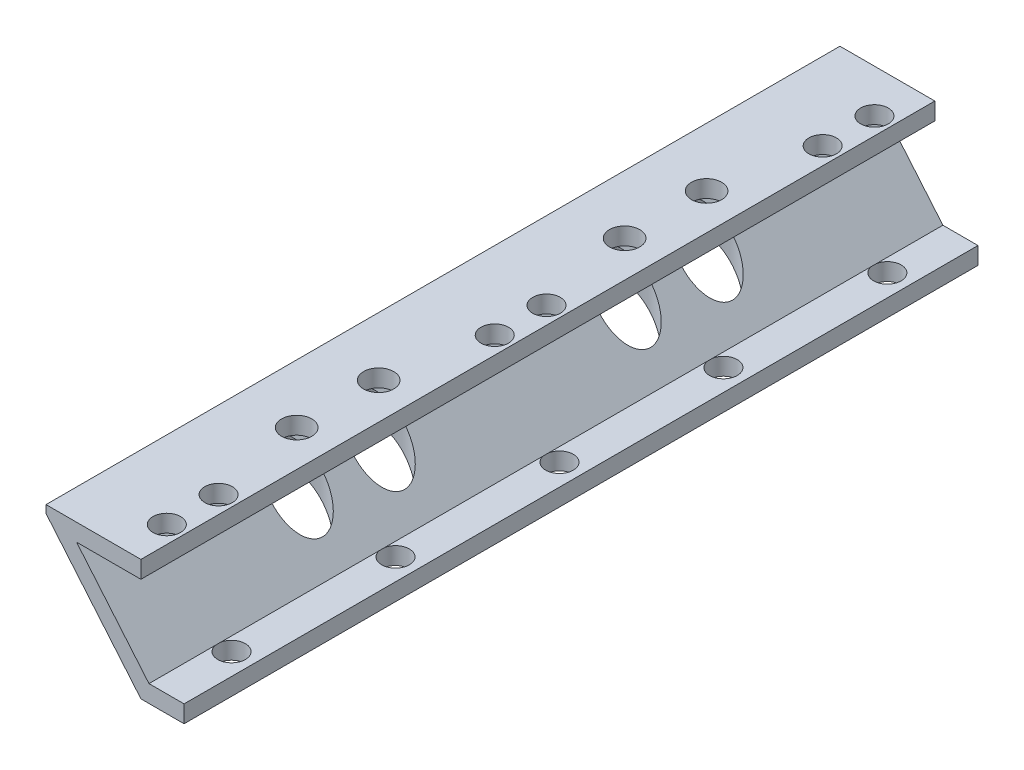
ISO-10303-21;
HEADER;
FILE_DESCRIPTION(('STEP AP214'),'2;1');
FILE_NAME('part.step','',(''),(''),'','','');
FILE_SCHEMA(('AUTOMOTIVE_DESIGN { 1 0 10303 214 1 1 1 1 }'));
ENDSEC;
DATA;
#1=APPLICATION_CONTEXT('core data for automotive mechanical design processes');
#2=APPLICATION_PROTOCOL_DEFINITION('international standard','automotive_design',2000,#1);
#3=PRODUCT_CONTEXT('',#1,'mechanical');
#4=PRODUCT('Part','Part','',(#3));
#5=PRODUCT_RELATED_PRODUCT_CATEGORY('part','',(#4));
#6=PRODUCT_DEFINITION_FORMATION('','',#4);
#7=PRODUCT_DEFINITION_CONTEXT('part definition',#1,'design');
#8=PRODUCT_DEFINITION('design','',#6,#7);
#9=PRODUCT_DEFINITION_SHAPE('','',#8);
#10=(LENGTH_UNIT() NAMED_UNIT(*) SI_UNIT(.MILLI.,.METRE.));
#11=(NAMED_UNIT(*) PLANE_ANGLE_UNIT() SI_UNIT($,.RADIAN.));
#12=(NAMED_UNIT(*) SI_UNIT($,.STERADIAN.) SOLID_ANGLE_UNIT());
#13=UNCERTAINTY_MEASURE_WITH_UNIT(LENGTH_MEASURE(1.E-05),#10,'distance_accuracy_value','');
#14=(GEOMETRIC_REPRESENTATION_CONTEXT(3) GLOBAL_UNCERTAINTY_ASSIGNED_CONTEXT((#13)) GLOBAL_UNIT_ASSIGNED_CONTEXT((#10,
#11,#12)) REPRESENTATION_CONTEXT('',''));
#15=CARTESIAN_POINT('',(0.,0.,0.));
#16=DIRECTION('',(0.,0.,1.));
#17=DIRECTION('',(1.,0.,0.));
#18=AXIS2_PLACEMENT_3D('',#15,#16,#17);
#19=CARTESIAN_POINT('',(-11.,12.,46.));
#20=DIRECTION('',(1.,0.,0.));
#21=DIRECTION('',(0.,0.,-1.));
#22=AXIS2_PLACEMENT_3D('',#19,#20,#21);
#23=PLANE('',#22);
#24=DIRECTION('',(0.,0.,-1.));
#25=VECTOR('',#24,1.);
#26=CARTESIAN_POINT('',(-11.,13.1092895185364,46.));
#27=LINE('',#26,#25);
#28=CARTESIAN_POINT('',(-11.,13.1092895185364,46.));
#29=VERTEX_POINT('',#28);
#30=CARTESIAN_POINT('',(-11.,13.1092895185363,-46.));
#31=VERTEX_POINT('',#30);
#32=EDGE_CURVE('E137',#29,#31,#27,.T.);
#33=ORIENTED_EDGE('',*,*,#32,.F.);
#34=DIRECTION('',(0.,-1.,0.));
#35=VECTOR('',#34,1.);
#36=CARTESIAN_POINT('',(-11.,12.,46.));
#37=LINE('',#36,#35);
#38=CARTESIAN_POINT('',(-11.,14.,46.));
#39=VERTEX_POINT('',#38);
#40=EDGE_CURVE('E147',#39,#29,#37,.T.);
#41=ORIENTED_EDGE('',*,*,#40,.F.);
#42=DIRECTION('',(0.,0.,-1.));
#43=VECTOR('',#42,1.);
#44=CARTESIAN_POINT('',(-11.,14.,46.));
#45=LINE('',#44,#43);
#46=CARTESIAN_POINT('',(-11.,14.,-46.));
#47=VERTEX_POINT('',#46);
#48=EDGE_CURVE('E154',#39,#47,#45,.T.);
#49=ORIENTED_EDGE('',*,*,#48,.T.);
#50=DIRECTION('',(0.,-1.,0.));
#51=VECTOR('',#50,1.);
#52=CARTESIAN_POINT('',(-11.,12.,-46.));
#53=LINE('',#52,#51);
#54=EDGE_CURVE('E143',#47,#31,#53,.T.);
#55=ORIENTED_EDGE('',*,*,#54,.T.);
#56=EDGE_LOOP('',(#33,#41,#49,#55));
#57=FACE_BOUND('',#56,.T.);
#58=ADVANCED_FACE('F33',(#57),#23,.F.);
#59=CARTESIAN_POINT('',(0.,0.,46.));
#60=DIRECTION('',(0.,0.,-1.));
#61=DIRECTION('',(-1.,0.,0.));
#62=AXIS2_PLACEMENT_3D('',#59,#60,#61);
#63=PLANE('',#62);
#64=ORIENTED_EDGE('',*,*,#40,.T.);
#65=DIRECTION('',(0.642787609686538,-0.766044443118979,0.));
#66=VECTOR('',#65,1.);
#67=CARTESIAN_POINT('',(0.,0.,46.));
#68=LINE('',#67,#66);
#69=CARTESIAN_POINT('',(0.,0.,46.));
#70=VERTEX_POINT('',#69);
#71=EDGE_CURVE('E135',#29,#70,#68,.T.);
#72=ORIENTED_EDGE('',*,*,#71,.T.);
#73=DIRECTION('',(1.,0.,0.));
#74=VECTOR('',#73,1.);
#75=CARTESIAN_POINT('',(4.99999999999773,0.,46.));
#76=LINE('',#75,#74);
#77=CARTESIAN_POINT('',(4.99999999999773,0.,46.));
#78=VERTEX_POINT('',#77);
#79=EDGE_CURVE('E142',#70,#78,#76,.T.);
#80=ORIENTED_EDGE('',*,*,#79,.T.);
#81=DIRECTION('',(0.,1.,0.));
#82=VECTOR('',#81,1.);
#83=CARTESIAN_POINT('',(4.99999999999773,2.00000000000477,46.));
#84=LINE('',#83,#82);
#85=CARTESIAN_POINT('',(4.99999999999773,2.00000000000477,46.));
#86=VERTEX_POINT('',#85);
#87=EDGE_CURVE('E183',#78,#86,#84,.T.);
#88=ORIENTED_EDGE('',*,*,#87,.T.);
#89=DIRECTION('',(-1.,-1.17531647254689E-12,0.));
#90=VECTOR('',#89,1.);
#91=CARTESIAN_POINT('',(0.932615316310018,1.99999999999999,46.));
#92=LINE('',#91,#90);
#93=CARTESIAN_POINT('',(0.932615316310018,1.99999999999999,46.));
#94=VERTEX_POINT('',#93);
#95=EDGE_CURVE('E215',#86,#94,#92,.T.);
#96=ORIENTED_EDGE('',*,*,#95,.T.);
#97=DIRECTION('',(-0.642787609686539,0.766044443118979,0.));
#98=VECTOR('',#97,1.);
#99=CARTESIAN_POINT('',(-7.45838099546278,12.,46.));
#100=LINE('',#99,#98);
#101=CARTESIAN_POINT('',(-7.45838099546278,12.,46.));
#102=VERTEX_POINT('',#101);
#103=EDGE_CURVE('E217',#94,#102,#100,.T.);
#104=ORIENTED_EDGE('',*,*,#103,.T.);
#105=DIRECTION('',(1.,0.,0.));
#106=VECTOR('',#105,1.);
#107=CARTESIAN_POINT('',(0.,12.,46.));
#108=LINE('',#107,#106);
#109=CARTESIAN_POINT('',(0.,12.,46.));
#110=VERTEX_POINT('',#109);
#111=EDGE_CURVE('E219',#102,#110,#108,.T.);
#112=ORIENTED_EDGE('',*,*,#111,.T.);
#113=DIRECTION('',(0.,1.,0.));
#114=VECTOR('',#113,1.);
#115=CARTESIAN_POINT('',(0.,14.,46.));
#116=LINE('',#115,#114);
#117=CARTESIAN_POINT('',(0.,14.,46.));
#118=VERTEX_POINT('',#117);
#119=EDGE_CURVE('E158',#110,#118,#116,.T.);
#120=ORIENTED_EDGE('',*,*,#119,.T.);
#121=DIRECTION('',(-1.,0.,0.));
#122=VECTOR('',#121,1.);
#123=CARTESIAN_POINT('',(-11.,14.,46.));
#124=LINE('',#123,#122);
#125=EDGE_CURVE('E152',#118,#39,#124,.T.);
#126=ORIENTED_EDGE('',*,*,#125,.T.);
#127=EDGE_LOOP('',(#64,#72,#80,#88,#96,#104,#112,#120,#126));
#128=FACE_BOUND('',#127,.T.);
#129=ADVANCED_FACE('F150',(#128),#63,.F.);
#130=CARTESIAN_POINT('',(0.,0.,-46.));
#131=DIRECTION('',(0.,0.,-1.));
#132=DIRECTION('',(-1.,0.,0.));
#133=AXIS2_PLACEMENT_3D('',#130,#131,#132);
#134=PLANE('',#133);
#135=DIRECTION('',(0.642787609686538,-0.766044443118979,0.));
#136=VECTOR('',#135,1.);
#137=CARTESIAN_POINT('',(0.,0.,-46.));
#138=LINE('',#137,#136);
#139=CARTESIAN_POINT('',(0.,0.,-46.));
#140=VERTEX_POINT('',#139);
#141=EDGE_CURVE('E48',#31,#140,#138,.T.);
#142=ORIENTED_EDGE('',*,*,#141,.F.);
#143=ORIENTED_EDGE('',*,*,#54,.F.);
#144=DIRECTION('',(-1.,0.,0.));
#145=VECTOR('',#144,1.);
#146=CARTESIAN_POINT('',(-11.,14.,-46.));
#147=LINE('',#146,#145);
#148=CARTESIAN_POINT('',(0.,14.,-46.));
#149=VERTEX_POINT('',#148);
#150=EDGE_CURVE('E209',#149,#47,#147,.T.);
#151=ORIENTED_EDGE('',*,*,#150,.F.);
#152=DIRECTION('',(0.,1.,0.));
#153=VECTOR('',#152,1.);
#154=CARTESIAN_POINT('',(0.,14.,-46.));
#155=LINE('',#154,#153);
#156=CARTESIAN_POINT('',(0.,12.,-46.));
#157=VERTEX_POINT('',#156);
#158=EDGE_CURVE('E206',#157,#149,#155,.T.);
#159=ORIENTED_EDGE('',*,*,#158,.F.);
#160=DIRECTION('',(1.,0.,0.));
#161=VECTOR('',#160,1.);
#162=CARTESIAN_POINT('',(0.,12.,-46.));
#163=LINE('',#162,#161);
#164=CARTESIAN_POINT('',(-7.45838099546278,12.,-46.));
#165=VERTEX_POINT('',#164);
#166=EDGE_CURVE('E203',#165,#157,#163,.T.);
#167=ORIENTED_EDGE('',*,*,#166,.F.);
#168=DIRECTION('',(-0.642787609686539,0.766044443118979,0.));
#169=VECTOR('',#168,1.);
#170=CARTESIAN_POINT('',(-7.45838099546278,12.,-46.));
#171=LINE('',#170,#169);
#172=CARTESIAN_POINT('',(0.932615316310018,1.99999999999999,-46.));
#173=VERTEX_POINT('',#172);
#174=EDGE_CURVE('E200',#173,#165,#171,.T.);
#175=ORIENTED_EDGE('',*,*,#174,.F.);
#176=DIRECTION('',(-1.,-1.17531647254689E-12,0.));
#177=VECTOR('',#176,1.);
#178=CARTESIAN_POINT('',(0.932615316310018,1.99999999999999,-46.));
#179=LINE('',#178,#177);
#180=CARTESIAN_POINT('',(4.99999999999773,2.00000000000477,-46.));
#181=VERTEX_POINT('',#180);
#182=EDGE_CURVE('E191',#181,#173,#179,.T.);
#183=ORIENTED_EDGE('',*,*,#182,.F.);
#184=DIRECTION('',(0.,1.,0.));
#185=VECTOR('',#184,1.);
#186=CARTESIAN_POINT('',(4.99999999999773,2.00000000000477,-46.));
#187=LINE('',#186,#185);
#188=CARTESIAN_POINT('',(4.99999999999773,0.,-46.));
#189=VERTEX_POINT('',#188);
#190=EDGE_CURVE('E182',#189,#181,#187,.T.);
#191=ORIENTED_EDGE('',*,*,#190,.F.);
#192=DIRECTION('',(1.,0.,0.));
#193=VECTOR('',#192,1.);
#194=CARTESIAN_POINT('',(4.99999999999773,0.,-46.));
#195=LINE('',#194,#193);
#196=EDGE_CURVE('E188',#140,#189,#195,.T.);
#197=ORIENTED_EDGE('',*,*,#196,.F.);
#198=EDGE_LOOP('',(#142,#143,#151,#159,#167,#175,#183,#191,#197));
#199=FACE_BOUND('',#198,.T.);
#200=ADVANCED_FACE('F187',(#199),#134,.T.);
#201=CARTESIAN_POINT('',(0.,0.,46.));
#202=DIRECTION('',(0.766044443118979,0.642787609686538,0.));
#203=DIRECTION('',(-0.642787609686538,0.766044443118979,0.));
#204=AXIS2_PLACEMENT_3D('',#201,#202,#203);
#205=PLANE('',#204);
#206=CARTESIAN_POINT('',(-4.19999999999866,5.0053650888941,-23.7500000000026));
#207=DIRECTION('',(0.766044443118979,0.642787609686538,0.));
#208=DIRECTION('',(-0.642787609686538,0.766044443118979,0.));
#209=AXIS2_PLACEMENT_3D('',#206,#207,#208);
#210=ELLIPSE('',#209,4.66717148058125,3.);
#211=CARTESIAN_POINT('',(-7.19999999999866,8.58062586667674,-23.7500000000026));
#212=VERTEX_POINT('',#211);
#213=EDGE_CURVE('E653',#212,#212,#210,.F.);
#214=ORIENTED_EDGE('',*,*,#213,.F.);
#215=EDGE_LOOP('',(#214));
#216=FACE_BOUND('',#215,.T.);
#217=CARTESIAN_POINT('',(-4.19999999999866,5.0053650888941,-14.2500000000012));
#218=DIRECTION('',(0.766044443118979,0.642787609686538,0.));
#219=DIRECTION('',(-0.642787609686538,0.766044443118979,0.));
#220=AXIS2_PLACEMENT_3D('',#217,#218,#219);
#221=ELLIPSE('',#220,4.66717148058125,3.);
#222=CARTESIAN_POINT('',(-7.19999999999866,8.58062586667674,-14.2500000000012));
#223=VERTEX_POINT('',#222);
#224=EDGE_CURVE('E657',#223,#223,#221,.F.);
#225=ORIENTED_EDGE('',*,*,#224,.F.);
#226=EDGE_LOOP('',(#225));
#227=FACE_BOUND('',#226,.T.);
#228=CARTESIAN_POINT('',(-4.19999999999865,5.0053650888941,14.2500000000012));
#229=DIRECTION('',(0.766044443118979,0.642787609686538,0.));
#230=DIRECTION('',(-0.642787609686538,0.766044443118979,0.));
#231=AXIS2_PLACEMENT_3D('',#228,#229,#230);
#232=ELLIPSE('',#231,4.66717148058125,3.);
#233=CARTESIAN_POINT('',(-7.19999999999866,8.58062586667674,14.2500000000012));
#234=VERTEX_POINT('',#233);
#235=EDGE_CURVE('E666',#234,#234,#232,.F.);
#236=ORIENTED_EDGE('',*,*,#235,.F.);
#237=EDGE_LOOP('',(#236));
#238=FACE_BOUND('',#237,.T.);
#239=CARTESIAN_POINT('',(-4.19999999999865,5.0053650888941,23.7500000000026));
#240=DIRECTION('',(0.766044443118979,0.642787609686538,0.));
#241=DIRECTION('',(-0.642787609686538,0.766044443118979,0.));
#242=AXIS2_PLACEMENT_3D('',#239,#240,#241);
#243=ELLIPSE('',#242,4.66717148058125,3.);
#244=CARTESIAN_POINT('',(-7.19999999999866,8.58062586667674,23.7500000000026));
#245=VERTEX_POINT('',#244);
#246=EDGE_CURVE('E672',#245,#245,#243,.F.);
#247=ORIENTED_EDGE('',*,*,#246,.F.);
#248=EDGE_LOOP('',(#247));
#249=FACE_BOUND('',#248,.T.);
#250=ORIENTED_EDGE('',*,*,#141,.T.);
#251=DIRECTION('',(0.,0.,-1.));
#252=VECTOR('',#251,1.);
#253=CARTESIAN_POINT('',(0.,0.,46.));
#254=LINE('',#253,#252);
#255=EDGE_CURVE('E11',#70,#140,#254,.T.);
#256=ORIENTED_EDGE('',*,*,#255,.F.);
#257=ORIENTED_EDGE('',*,*,#71,.F.);
#258=ORIENTED_EDGE('',*,*,#32,.T.);
#259=EDGE_LOOP('',(#250,#256,#257,#258));
#260=FACE_BOUND('',#259,.T.);
#261=ADVANCED_FACE('F35',(#216,#227,#238,#249,#260),#205,.F.);
#262=CARTESIAN_POINT('',(-7.45838099546278,12.,46.));
#263=DIRECTION('',(-0.766044443118979,-0.642787609686538,0.));
#264=DIRECTION('',(0.642787609686539,-0.766044443118979,0.));
#265=AXIS2_PLACEMENT_3D('',#262,#263,#264);
#266=PLANE('',#265);
#267=CARTESIAN_POINT('',(-4.19999999999866,8.11681274261494,-14.2500000000012));
#268=DIRECTION('',(-0.766044443118979,-0.642787609686538,0.));
#269=DIRECTION('',(-0.642787609686539,0.766044443118979,0.));
#270=AXIS2_PLACEMENT_3D('',#267,#268,#269);
#271=ELLIPSE('',#270,4.66717148058125,3.);
#272=CARTESIAN_POINT('',(-7.19999999999866,11.6920735203976,-14.2500000000012));
#273=VERTEX_POINT('',#272);
#274=EDGE_CURVE('E654',#273,#273,#271,.F.);
#275=ORIENTED_EDGE('',*,*,#274,.F.);
#276=EDGE_LOOP('',(#275));
#277=FACE_BOUND('',#276,.T.);
#278=CARTESIAN_POINT('',(-4.19999999999866,8.11681274261493,23.7500000000026));
#279=DIRECTION('',(-0.766044443118979,-0.642787609686538,0.));
#280=DIRECTION('',(-0.642787609686539,0.766044443118979,0.));
#281=AXIS2_PLACEMENT_3D('',#278,#279,#280);
#282=ELLIPSE('',#281,4.66717148058125,3.);
#283=CARTESIAN_POINT('',(-7.19999999999866,11.6920735203976,23.7500000000026));
#284=VERTEX_POINT('',#283);
#285=EDGE_CURVE('E669',#284,#284,#282,.F.);
#286=ORIENTED_EDGE('',*,*,#285,.F.);
#287=EDGE_LOOP('',(#286));
#288=FACE_BOUND('',#287,.T.);
#289=DIRECTION('',(0.,0.,-1.));
#290=VECTOR('',#289,1.);
#291=CARTESIAN_POINT('',(0.932615316310018,1.99999999999999,46.));
#292=LINE('',#291,#290);
#293=CARTESIAN_POINT('',(0.932615316310018,1.99999999999999,38.3214113460168));
#294=VERTEX_POINT('',#293);
#295=EDGE_CURVE('E168',#94,#294,#292,.T.);
#296=ORIENTED_EDGE('',*,*,#295,.T.);
#297=CARTESIAN_POINT('',(0.932615316310018,1.99999999999999,37.6785886539941));
#298=VERTEX_POINT('',#297);
#299=EDGE_CURVE('E172',#294,#298,#292,.T.);
#300=ORIENTED_EDGE('',*,*,#299,.T.);
#301=CARTESIAN_POINT('',(0.932615316310018,1.99999999999999,19.3214113460141));
#302=VERTEX_POINT('',#301);
#303=EDGE_CURVE('E173',#298,#302,#292,.T.);
#304=ORIENTED_EDGE('',*,*,#303,.T.);
#305=CARTESIAN_POINT('',(0.932615316310018,1.99999999999999,18.6785886539913));
#306=VERTEX_POINT('',#305);
#307=EDGE_CURVE('E252',#302,#306,#292,.T.);
#308=ORIENTED_EDGE('',*,*,#307,.T.);
#309=CARTESIAN_POINT('',(0.932615316310018,1.99999999999999,0.321411346011401));
#310=VERTEX_POINT('',#309);
#311=EDGE_CURVE('E251',#306,#310,#292,.T.);
#312=ORIENTED_EDGE('',*,*,#311,.T.);
#313=CARTESIAN_POINT('',(0.932615316310018,1.99999999999999,-0.321411346011401));
#314=VERTEX_POINT('',#313);
#315=EDGE_CURVE('E253',#310,#314,#292,.T.);
#316=ORIENTED_EDGE('',*,*,#315,.T.);
#317=CARTESIAN_POINT('',(0.932615316310018,1.99999999999999,-18.6785886539913));
#318=VERTEX_POINT('',#317);
#319=EDGE_CURVE('E257',#314,#318,#292,.T.);
#320=ORIENTED_EDGE('',*,*,#319,.T.);
#321=CARTESIAN_POINT('',(0.932615316310018,1.99999999999999,-19.3214113460141));
#322=VERTEX_POINT('',#321);
#323=EDGE_CURVE('E259',#318,#322,#292,.T.);
#324=ORIENTED_EDGE('',*,*,#323,.T.);
#325=CARTESIAN_POINT('',(0.932615316310018,1.99999999999999,-37.6785886539941));
#326=VERTEX_POINT('',#325);
#327=EDGE_CURVE('E258',#322,#326,#292,.T.);
#328=ORIENTED_EDGE('',*,*,#327,.T.);
#329=CARTESIAN_POINT('',(0.932615316310018,1.99999999999999,-38.3214113460169));
#330=VERTEX_POINT('',#329);
#331=EDGE_CURVE('E174',#326,#330,#292,.T.);
#332=ORIENTED_EDGE('',*,*,#331,.T.);
#333=EDGE_CURVE('E167',#330,#173,#292,.T.);
#334=ORIENTED_EDGE('',*,*,#333,.T.);
#335=ORIENTED_EDGE('',*,*,#174,.T.);
#336=DIRECTION('',(0.,0.,-1.));
#337=VECTOR('',#336,1.);
#338=CARTESIAN_POINT('',(-7.45838099546278,12.,46.));
#339=LINE('',#338,#337);
#340=EDGE_CURVE('E165',#102,#165,#339,.T.);
#341=ORIENTED_EDGE('',*,*,#340,.F.);
#342=ORIENTED_EDGE('',*,*,#103,.F.);
#343=EDGE_LOOP('',(#296,#300,#304,#308,#312,#316,#320,#324,#328,#332,#334,#335,#341,#342));
#344=FACE_BOUND('',#343,.T.);
#345=CARTESIAN_POINT('',(-4.19999999999866,8.11681274261493,14.2500000000012));
#346=DIRECTION('',(-0.766044443118979,-0.642787609686538,0.));
#347=DIRECTION('',(-0.642787609686539,0.766044443118979,0.));
#348=AXIS2_PLACEMENT_3D('',#345,#346,#347);
#349=ELLIPSE('',#348,4.66717148058125,3.);
#350=CARTESIAN_POINT('',(-7.19999999999866,11.6920735203976,14.2500000000012));
#351=VERTEX_POINT('',#350);
#352=EDGE_CURVE('E663',#351,#351,#349,.F.);
#353=ORIENTED_EDGE('',*,*,#352,.F.);
#354=EDGE_LOOP('',(#353));
#355=FACE_BOUND('',#354,.T.);
#356=CARTESIAN_POINT('',(-4.19999999999866,8.11681274261494,-23.7500000000026));
#357=DIRECTION('',(-0.766044443118979,-0.642787609686538,0.));
#358=DIRECTION('',(-0.642787609686539,0.766044443118979,0.));
#359=AXIS2_PLACEMENT_3D('',#356,#357,#358);
#360=ELLIPSE('',#359,4.66717148058125,3.);
#361=CARTESIAN_POINT('',(-7.19999999999866,11.6920735203976,-23.7500000000026));
#362=VERTEX_POINT('',#361);
#363=EDGE_CURVE('E148',#362,#362,#360,.F.);
#364=ORIENTED_EDGE('',*,*,#363,.F.);
#365=EDGE_LOOP('',(#364));
#366=FACE_BOUND('',#365,.T.);
#367=ADVANCED_FACE('F237',(#277,#288,#344,#355,#366),#266,.F.);
#368=CARTESIAN_POINT('',(4.99999999999773,0.,46.));
#369=DIRECTION('',(0.,1.,0.));
#370=DIRECTION('',(0.,0.,1.));
#371=AXIS2_PLACEMENT_3D('',#368,#369,#370);
#372=PLANE('',#371);
#373=CARTESIAN_POINT('',(2.49999999999891,0.,38.0000000000055));
#374=DIRECTION('',(0.,1.,0.));
#375=DIRECTION('',(0.,0.,1.));
#376=AXIS2_PLACEMENT_3D('',#373,#374,#375);
#377=CIRCLE('',#376,1.6);
#378=CARTESIAN_POINT('',(2.49999999999891,0.,39.6000000000055));
#379=VERTEX_POINT('',#378);
#380=EDGE_CURVE('E357',#379,#379,#377,.T.);
#381=ORIENTED_EDGE('',*,*,#380,.T.);
#382=EDGE_LOOP('',(#381));
#383=FACE_BOUND('',#382,.T.);
#384=CARTESIAN_POINT('',(2.4999999999989,0.,19.0000000000027));
#385=DIRECTION('',(0.,1.,0.));
#386=DIRECTION('',(0.,0.,1.));
#387=AXIS2_PLACEMENT_3D('',#384,#385,#386);
#388=CIRCLE('',#387,1.6);
#389=CARTESIAN_POINT('',(2.4999999999989,0.,20.6000000000027));
#390=VERTEX_POINT('',#389);
#391=EDGE_CURVE('E361',#390,#390,#388,.T.);
#392=ORIENTED_EDGE('',*,*,#391,.T.);
#393=EDGE_LOOP('',(#392));
#394=FACE_BOUND('',#393,.T.);
#395=CARTESIAN_POINT('',(2.4999999999989,0.,0.));
#396=DIRECTION('',(0.,1.,0.));
#397=DIRECTION('',(0.,0.,1.));
#398=AXIS2_PLACEMENT_3D('',#395,#396,#397);
#399=CIRCLE('',#398,1.6);
#400=CARTESIAN_POINT('',(2.4999999999989,0.,1.6));
#401=VERTEX_POINT('',#400);
#402=EDGE_CURVE('E365',#401,#401,#399,.T.);
#403=ORIENTED_EDGE('',*,*,#402,.T.);
#404=EDGE_LOOP('',(#403));
#405=FACE_BOUND('',#404,.T.);
#406=CARTESIAN_POINT('',(2.4999999999989,0.,-19.0000000000027));
#407=DIRECTION('',(0.,1.,0.));
#408=DIRECTION('',(0.,0.,1.));
#409=AXIS2_PLACEMENT_3D('',#406,#407,#408);
#410=CIRCLE('',#409,1.6);
#411=CARTESIAN_POINT('',(2.4999999999989,0.,-17.4000000000027));
#412=VERTEX_POINT('',#411);
#413=EDGE_CURVE('E272',#412,#412,#410,.T.);
#414=ORIENTED_EDGE('',*,*,#413,.T.);
#415=EDGE_LOOP('',(#414));
#416=FACE_BOUND('',#415,.T.);
#417=CARTESIAN_POINT('',(2.4999999999989,0.,-38.0000000000055));
#418=DIRECTION('',(0.,1.,0.));
#419=DIRECTION('',(0.,0.,1.));
#420=AXIS2_PLACEMENT_3D('',#417,#418,#419);
#421=CIRCLE('',#420,1.6);
#422=CARTESIAN_POINT('',(2.4999999999989,0.,-36.4000000000055));
#423=VERTEX_POINT('',#422);
#424=EDGE_CURVE('E275',#423,#423,#421,.T.);
#425=ORIENTED_EDGE('',*,*,#424,.T.);
#426=EDGE_LOOP('',(#425));
#427=FACE_BOUND('',#426,.T.);
#428=ORIENTED_EDGE('',*,*,#255,.T.);
#429=ORIENTED_EDGE('',*,*,#196,.T.);
#430=DIRECTION('',(0.,0.,-1.));
#431=VECTOR('',#430,1.);
#432=CARTESIAN_POINT('',(4.99999999999773,0.,46.));
#433=LINE('',#432,#431);
#434=EDGE_CURVE('E41',#78,#189,#433,.T.);
#435=ORIENTED_EDGE('',*,*,#434,.F.);
#436=ORIENTED_EDGE('',*,*,#79,.F.);
#437=EDGE_LOOP('',(#428,#429,#435,#436));
#438=FACE_BOUND('',#437,.T.);
#439=ADVANCED_FACE('F193',(#383,#394,#405,#416,#427,#438),#372,.F.);
#440=CARTESIAN_POINT('',(4.99999999999773,2.00000000000477,46.));
#441=DIRECTION('',(-1.,0.,0.));
#442=DIRECTION('',(0.,0.,1.));
#443=AXIS2_PLACEMENT_3D('',#440,#441,#442);
#444=PLANE('',#443);
#445=ORIENTED_EDGE('',*,*,#434,.T.);
#446=ORIENTED_EDGE('',*,*,#190,.T.);
#447=DIRECTION('',(0.,0.,-1.));
#448=VECTOR('',#447,1.);
#449=CARTESIAN_POINT('',(4.99999999999773,2.00000000000477,46.));
#450=LINE('',#449,#448);
#451=EDGE_CURVE('E171',#86,#181,#450,.T.);
#452=ORIENTED_EDGE('',*,*,#451,.F.);
#453=ORIENTED_EDGE('',*,*,#87,.F.);
#454=EDGE_LOOP('',(#445,#446,#452,#453));
#455=FACE_BOUND('',#454,.T.);
#456=ADVANCED_FACE('F180',(#455),#444,.F.);
#457=CARTESIAN_POINT('',(0.932615316310018,1.99999999999999,46.));
#458=DIRECTION('',(1.17531647254689E-12,-1.,0.));
#459=DIRECTION('',(1.,1.17531647254689E-12,0.));
#460=AXIS2_PLACEMENT_3D('',#457,#458,#459);
#461=PLANE('',#460);
#462=ORIENTED_EDGE('',*,*,#303,.F.);
#463=CARTESIAN_POINT('',(2.49999999999655,2.00000000000183,38.0000000000055));
#464=DIRECTION('',(-1.17531647254689E-12,1.,0.));
#465=DIRECTION('',(-1.,-1.17531647254689E-12,0.));
#466=AXIS2_PLACEMENT_3D('',#463,#464,#465);
#467=CIRCLE('',#466,1.6);
#468=EDGE_CURVE('E55',#294,#298,#467,.T.);
#469=ORIENTED_EDGE('',*,*,#468,.F.);
#470=ORIENTED_EDGE('',*,*,#295,.F.);
#471=ORIENTED_EDGE('',*,*,#95,.F.);
#472=ORIENTED_EDGE('',*,*,#451,.T.);
#473=ORIENTED_EDGE('',*,*,#182,.T.);
#474=ORIENTED_EDGE('',*,*,#333,.F.);
#475=CARTESIAN_POINT('',(2.49999999999655,2.00000000000183,-38.0000000000055));
#476=DIRECTION('',(-1.17531647254689E-12,1.,0.));
#477=DIRECTION('',(-1.,-1.17531647254689E-12,0.));
#478=AXIS2_PLACEMENT_3D('',#475,#476,#477);
#479=CIRCLE('',#478,1.6);
#480=EDGE_CURVE('E271',#326,#330,#479,.T.);
#481=ORIENTED_EDGE('',*,*,#480,.F.);
#482=ORIENTED_EDGE('',*,*,#327,.F.);
#483=CARTESIAN_POINT('',(2.49999999999655,2.00000000000183,-19.0000000000027));
#484=DIRECTION('',(-1.17531647254689E-12,1.,0.));
#485=DIRECTION('',(-1.,-1.17531647254689E-12,0.));
#486=AXIS2_PLACEMENT_3D('',#483,#484,#485);
#487=CIRCLE('',#486,1.6);
#488=EDGE_CURVE('E710',#318,#322,#487,.T.);
#489=ORIENTED_EDGE('',*,*,#488,.F.);
#490=ORIENTED_EDGE('',*,*,#319,.F.);
#491=CARTESIAN_POINT('',(2.49999999999655,2.00000000000183,0.));
#492=DIRECTION('',(-1.17531647254689E-12,1.,0.));
#493=DIRECTION('',(-1.,-1.17531647254689E-12,0.));
#494=AXIS2_PLACEMENT_3D('',#491,#492,#493);
#495=CIRCLE('',#494,1.6);
#496=EDGE_CURVE('E707',#310,#314,#495,.T.);
#497=ORIENTED_EDGE('',*,*,#496,.F.);
#498=ORIENTED_EDGE('',*,*,#311,.F.);
#499=CARTESIAN_POINT('',(2.49999999999655,2.00000000000183,19.0000000000027));
#500=DIRECTION('',(-1.17531647254689E-12,1.,0.));
#501=DIRECTION('',(-1.,-1.17531647254689E-12,0.));
#502=AXIS2_PLACEMENT_3D('',#499,#500,#501);
#503=CIRCLE('',#502,1.6);
#504=EDGE_CURVE('E703',#302,#306,#503,.T.);
#505=ORIENTED_EDGE('',*,*,#504,.F.);
#506=EDGE_LOOP('',(#462,#469,#470,#471,#472,#473,#474,#481,#482,#489,#490,#497,#498,#505));
#507=FACE_BOUND('',#506,.T.);
#508=ADVANCED_FACE('F243',(#507),#461,.F.);
#509=CARTESIAN_POINT('',(0.,12.,46.));
#510=DIRECTION('',(0.,1.,0.));
#511=DIRECTION('',(-1.,0.,0.));
#512=AXIS2_PLACEMENT_3D('',#509,#510,#511);
#513=PLANE('',#512);
#514=CARTESIAN_POINT('',(-4.19999999999866,12.,-23.7500000000026));
#515=DIRECTION('',(0.,1.,0.));
#516=DIRECTION('',(-1.,0.,0.));
#517=AXIS2_PLACEMENT_3D('',#514,#515,#516);
#518=CIRCLE('',#517,1.75);
#519=CARTESIAN_POINT('',(-5.94999999999866,12.,-23.7500000000026));
#520=VERTEX_POINT('',#519);
#521=EDGE_CURVE('E696',#520,#520,#518,.T.);
#522=ORIENTED_EDGE('',*,*,#521,.T.);
#523=EDGE_LOOP('',(#522));
#524=FACE_BOUND('',#523,.T.);
#525=CARTESIAN_POINT('',(-4.19999999999865,12.,14.2500000000012));
#526=DIRECTION('',(0.,1.,0.));
#527=DIRECTION('',(-1.,0.,0.));
#528=AXIS2_PLACEMENT_3D('',#525,#526,#527);
#529=CIRCLE('',#528,1.75);
#530=CARTESIAN_POINT('',(-5.94999999999865,12.,14.2500000000012));
#531=VERTEX_POINT('',#530);
#532=EDGE_CURVE('E684',#531,#531,#529,.T.);
#533=ORIENTED_EDGE('',*,*,#532,.T.);
#534=EDGE_LOOP('',(#533));
#535=FACE_BOUND('',#534,.T.);
#536=CARTESIAN_POINT('',(-2.00000000000477,12.,40.9999999999984));
#537=DIRECTION('',(0.,1.,0.));
#538=DIRECTION('',(-1.,0.,0.));
#539=AXIS2_PLACEMENT_3D('',#536,#537,#538);
#540=CIRCLE('',#539,1.6);
#541=CARTESIAN_POINT('',(-3.60000000000477,12.,40.9999999999984));
#542=VERTEX_POINT('',#541);
#543=EDGE_CURVE('E284',#542,#542,#540,.T.);
#544=ORIENTED_EDGE('',*,*,#543,.T.);
#545=EDGE_LOOP('',(#544));
#546=FACE_BOUND('',#545,.T.);
#547=CARTESIAN_POINT('',(-2.00000000000477,12.,34.9999999999983));
#548=DIRECTION('',(0.,1.,0.));
#549=DIRECTION('',(-1.,0.,0.));
#550=AXIS2_PLACEMENT_3D('',#547,#548,#549);
#551=CIRCLE('',#550,1.6);
#552=CARTESIAN_POINT('',(-3.60000000000477,12.,34.9999999999983));
#553=VERTEX_POINT('',#552);
#554=EDGE_CURVE('E290',#553,#553,#551,.T.);
#555=ORIENTED_EDGE('',*,*,#554,.T.);
#556=EDGE_LOOP('',(#555));
#557=FACE_BOUND('',#556,.T.);
#558=CARTESIAN_POINT('',(-2.00000000000477,12.,2.99999999999295));
#559=DIRECTION('',(0.,1.,0.));
#560=DIRECTION('',(-1.,0.,0.));
#561=AXIS2_PLACEMENT_3D('',#558,#559,#560);
#562=CIRCLE('',#561,1.6);
#563=CARTESIAN_POINT('',(-3.60000000000477,12.,2.99999999999295));
#564=VERTEX_POINT('',#563);
#565=EDGE_CURVE('E296',#564,#564,#562,.T.);
#566=ORIENTED_EDGE('',*,*,#565,.T.);
#567=EDGE_LOOP('',(#566));
#568=FACE_BOUND('',#567,.T.);
#569=CARTESIAN_POINT('',(-2.00000000000477,12.,-2.99999999999295));
#570=DIRECTION('',(0.,1.,0.));
#571=DIRECTION('',(-1.,0.,0.));
#572=AXIS2_PLACEMENT_3D('',#569,#570,#571);
#573=CIRCLE('',#572,1.6);
#574=CARTESIAN_POINT('',(-3.60000000000477,12.,-2.99999999999295));
#575=VERTEX_POINT('',#574);
#576=EDGE_CURVE('E302',#575,#575,#573,.T.);
#577=ORIENTED_EDGE('',*,*,#576,.T.);
#578=EDGE_LOOP('',(#577));
#579=FACE_BOUND('',#578,.T.);
#580=CARTESIAN_POINT('',(-2.00000000000477,12.,-34.9999999999983));
#581=DIRECTION('',(0.,1.,0.));
#582=DIRECTION('',(-1.,0.,0.));
#583=AXIS2_PLACEMENT_3D('',#580,#581,#582);
#584=CIRCLE('',#583,1.6);
#585=CARTESIAN_POINT('',(-3.60000000000477,12.,-34.9999999999983));
#586=VERTEX_POINT('',#585);
#587=EDGE_CURVE('E308',#586,#586,#584,.T.);
#588=ORIENTED_EDGE('',*,*,#587,.T.);
#589=EDGE_LOOP('',(#588));
#590=FACE_BOUND('',#589,.T.);
#591=CARTESIAN_POINT('',(-2.00000000000477,12.,-40.9999999999984));
#592=DIRECTION('',(0.,1.,0.));
#593=DIRECTION('',(-1.,0.,0.));
#594=AXIS2_PLACEMENT_3D('',#591,#592,#593);
#595=CIRCLE('',#594,1.6);
#596=CARTESIAN_POINT('',(-3.60000000000477,12.,-40.9999999999984));
#597=VERTEX_POINT('',#596);
#598=EDGE_CURVE('E195',#597,#597,#595,.T.);
#599=ORIENTED_EDGE('',*,*,#598,.T.);
#600=EDGE_LOOP('',(#599));
#601=FACE_BOUND('',#600,.T.);
#602=ORIENTED_EDGE('',*,*,#340,.T.);
#603=ORIENTED_EDGE('',*,*,#166,.T.);
#604=DIRECTION('',(0.,0.,-1.));
#605=VECTOR('',#604,1.);
#606=CARTESIAN_POINT('',(0.,12.,46.));
#607=LINE('',#606,#605);
#608=EDGE_CURVE('E163',#110,#157,#607,.T.);
#609=ORIENTED_EDGE('',*,*,#608,.F.);
#610=ORIENTED_EDGE('',*,*,#111,.F.);
#611=EDGE_LOOP('',(#602,#603,#609,#610));
#612=FACE_BOUND('',#611,.T.);
#613=CARTESIAN_POINT('',(-4.19999999999865,12.,23.7500000000026));
#614=DIRECTION('',(0.,1.,0.));
#615=DIRECTION('',(-1.,0.,0.));
#616=AXIS2_PLACEMENT_3D('',#613,#614,#615);
#617=CIRCLE('',#616,1.75);
#618=CARTESIAN_POINT('',(-5.94999999999866,12.,23.7500000000026));
#619=VERTEX_POINT('',#618);
#620=EDGE_CURVE('E678',#619,#619,#617,.T.);
#621=ORIENTED_EDGE('',*,*,#620,.T.);
#622=EDGE_LOOP('',(#621));
#623=FACE_BOUND('',#622,.T.);
#624=CARTESIAN_POINT('',(-4.19999999999866,12.,-14.2500000000012));
#625=DIRECTION('',(0.,1.,0.));
#626=DIRECTION('',(-1.,0.,0.));
#627=AXIS2_PLACEMENT_3D('',#624,#625,#626);
#628=CIRCLE('',#627,1.75);
#629=CARTESIAN_POINT('',(-5.94999999999866,12.,-14.2500000000012));
#630=VERTEX_POINT('',#629);
#631=EDGE_CURVE('E690',#630,#630,#628,.T.);
#632=ORIENTED_EDGE('',*,*,#631,.T.);
#633=EDGE_LOOP('',(#632));
#634=FACE_BOUND('',#633,.T.);
#635=ADVANCED_FACE('F232',(#524,#535,#546,#557,#568,#579,#590,#601,#612,#623,#634),#513,.F.);
#636=CARTESIAN_POINT('',(0.,14.,46.));
#637=DIRECTION('',(-1.,0.,0.));
#638=DIRECTION('',(0.,0.,1.));
#639=AXIS2_PLACEMENT_3D('',#636,#637,#638);
#640=PLANE('',#639);
#641=ORIENTED_EDGE('',*,*,#608,.T.);
#642=ORIENTED_EDGE('',*,*,#158,.T.);
#643=DIRECTION('',(0.,0.,-1.));
#644=VECTOR('',#643,1.);
#645=CARTESIAN_POINT('',(0.,14.,46.));
#646=LINE('',#645,#644);
#647=EDGE_CURVE('E156',#118,#149,#646,.T.);
#648=ORIENTED_EDGE('',*,*,#647,.F.);
#649=ORIENTED_EDGE('',*,*,#119,.F.);
#650=EDGE_LOOP('',(#641,#642,#648,#649));
#651=FACE_BOUND('',#650,.T.);
#652=ADVANCED_FACE('F225',(#651),#640,.F.);
#653=CARTESIAN_POINT('',(-11.,14.,46.));
#654=DIRECTION('',(0.,-1.,0.));
#655=DIRECTION('',(0.,0.,-1.));
#656=AXIS2_PLACEMENT_3D('',#653,#654,#655);
#657=PLANE('',#656);
#658=CARTESIAN_POINT('',(-4.19999999999865,14.,23.7500000000026));
#659=DIRECTION('',(0.,1.,0.));
#660=DIRECTION('',(0.,0.,1.));
#661=AXIS2_PLACEMENT_3D('',#658,#659,#660);
#662=CIRCLE('',#661,1.75);
#663=CARTESIAN_POINT('',(-4.19999999999865,14.,25.5000000000026));
#664=VERTEX_POINT('',#663);
#665=EDGE_CURVE('E675',#664,#664,#662,.T.);
#666=ORIENTED_EDGE('',*,*,#665,.F.);
#667=EDGE_LOOP('',(#666));
#668=FACE_BOUND('',#667,.T.);
#669=CARTESIAN_POINT('',(-4.19999999999865,14.,14.2500000000012));
#670=DIRECTION('',(0.,1.,0.));
#671=DIRECTION('',(0.,0.,1.));
#672=AXIS2_PLACEMENT_3D('',#669,#670,#671);
#673=CIRCLE('',#672,1.75);
#674=CARTESIAN_POINT('',(-4.19999999999865,14.,16.0000000000012));
#675=VERTEX_POINT('',#674);
#676=EDGE_CURVE('E681',#675,#675,#673,.T.);
#677=ORIENTED_EDGE('',*,*,#676,.F.);
#678=EDGE_LOOP('',(#677));
#679=FACE_BOUND('',#678,.T.);
#680=CARTESIAN_POINT('',(-4.19999999999866,14.,-14.2500000000012));
#681=DIRECTION('',(0.,1.,0.));
#682=DIRECTION('',(0.,0.,1.));
#683=AXIS2_PLACEMENT_3D('',#680,#681,#682);
#684=CIRCLE('',#683,1.75);
#685=CARTESIAN_POINT('',(-4.19999999999866,14.,-12.5000000000012));
#686=VERTEX_POINT('',#685);
#687=EDGE_CURVE('E687',#686,#686,#684,.T.);
#688=ORIENTED_EDGE('',*,*,#687,.F.);
#689=EDGE_LOOP('',(#688));
#690=FACE_BOUND('',#689,.T.);
#691=CARTESIAN_POINT('',(-4.19999999999866,14.,-23.7500000000026));
#692=DIRECTION('',(0.,1.,0.));
#693=DIRECTION('',(0.,0.,1.));
#694=AXIS2_PLACEMENT_3D('',#691,#692,#693);
#695=CIRCLE('',#694,1.75);
#696=CARTESIAN_POINT('',(-4.19999999999866,14.,-22.0000000000026));
#697=VERTEX_POINT('',#696);
#698=EDGE_CURVE('E693',#697,#697,#695,.T.);
#699=ORIENTED_EDGE('',*,*,#698,.F.);
#700=EDGE_LOOP('',(#699));
#701=FACE_BOUND('',#700,.T.);
#702=CARTESIAN_POINT('',(-2.00000000000477,14.,40.9999999999984));
#703=DIRECTION('',(0.,1.,0.));
#704=DIRECTION('',(0.,0.,1.));
#705=AXIS2_PLACEMENT_3D('',#702,#703,#704);
#706=CIRCLE('',#705,1.6);
#707=CARTESIAN_POINT('',(-2.00000000000477,14.,42.5999999999984));
#708=VERTEX_POINT('',#707);
#709=EDGE_CURVE('E277',#708,#708,#706,.T.);
#710=ORIENTED_EDGE('',*,*,#709,.F.);
#711=EDGE_LOOP('',(#710));
#712=FACE_BOUND('',#711,.T.);
#713=CARTESIAN_POINT('',(-2.00000000000477,14.,34.9999999999983));
#714=DIRECTION('',(0.,1.,0.));
#715=DIRECTION('',(0.,0.,1.));
#716=AXIS2_PLACEMENT_3D('',#713,#714,#715);
#717=CIRCLE('',#716,1.6);
#718=CARTESIAN_POINT('',(-2.00000000000477,14.,36.5999999999983));
#719=VERTEX_POINT('',#718);
#720=EDGE_CURVE('E287',#719,#719,#717,.T.);
#721=ORIENTED_EDGE('',*,*,#720,.F.);
#722=EDGE_LOOP('',(#721));
#723=FACE_BOUND('',#722,.T.);
#724=CARTESIAN_POINT('',(-2.00000000000477,14.,2.99999999999295));
#725=DIRECTION('',(0.,1.,0.));
#726=DIRECTION('',(0.,0.,1.));
#727=AXIS2_PLACEMENT_3D('',#724,#725,#726);
#728=CIRCLE('',#727,1.6);
#729=CARTESIAN_POINT('',(-2.00000000000477,14.,4.59999999999295));
#730=VERTEX_POINT('',#729);
#731=EDGE_CURVE('E293',#730,#730,#728,.T.);
#732=ORIENTED_EDGE('',*,*,#731,.F.);
#733=EDGE_LOOP('',(#732));
#734=FACE_BOUND('',#733,.T.);
#735=CARTESIAN_POINT('',(-2.00000000000477,14.,-2.99999999999295));
#736=DIRECTION('',(0.,1.,0.));
#737=DIRECTION('',(0.,0.,1.));
#738=AXIS2_PLACEMENT_3D('',#735,#736,#737);
#739=CIRCLE('',#738,1.6);
#740=CARTESIAN_POINT('',(-2.00000000000477,14.,-1.39999999999295));
#741=VERTEX_POINT('',#740);
#742=EDGE_CURVE('E299',#741,#741,#739,.T.);
#743=ORIENTED_EDGE('',*,*,#742,.F.);
#744=EDGE_LOOP('',(#743));
#745=FACE_BOUND('',#744,.T.);
#746=CARTESIAN_POINT('',(-2.00000000000477,14.,-34.9999999999983));
#747=DIRECTION('',(0.,1.,0.));
#748=DIRECTION('',(0.,0.,1.));
#749=AXIS2_PLACEMENT_3D('',#746,#747,#748);
#750=CIRCLE('',#749,1.6);
#751=CARTESIAN_POINT('',(-2.00000000000477,14.,-33.3999999999983));
#752=VERTEX_POINT('',#751);
#753=EDGE_CURVE('E305',#752,#752,#750,.T.);
#754=ORIENTED_EDGE('',*,*,#753,.F.);
#755=EDGE_LOOP('',(#754));
#756=FACE_BOUND('',#755,.T.);
#757=CARTESIAN_POINT('',(-2.00000000000477,14.,-40.9999999999984));
#758=DIRECTION('',(0.,1.,0.));
#759=DIRECTION('',(0.,0.,1.));
#760=AXIS2_PLACEMENT_3D('',#757,#758,#759);
#761=CIRCLE('',#760,1.6);
#762=CARTESIAN_POINT('',(-2.00000000000477,14.,-39.3999999999984));
#763=VERTEX_POINT('',#762);
#764=EDGE_CURVE('E311',#763,#763,#761,.T.);
#765=ORIENTED_EDGE('',*,*,#764,.F.);
#766=EDGE_LOOP('',(#765));
#767=FACE_BOUND('',#766,.T.);
#768=ORIENTED_EDGE('',*,*,#647,.T.);
#769=ORIENTED_EDGE('',*,*,#150,.T.);
#770=ORIENTED_EDGE('',*,*,#48,.F.);
#771=ORIENTED_EDGE('',*,*,#125,.F.);
#772=EDGE_LOOP('',(#768,#769,#770,#771));
#773=FACE_BOUND('',#772,.T.);
#774=ADVANCED_FACE('F229',(#668,#679,#690,#701,#712,#723,#734,#745,#756,#767,#773),#657,.F.);
#775=CARTESIAN_POINT('',(-2.00000000000477,9.00000000000001,-40.9999999999984));
#776=DIRECTION('',(0.,1.,0.));
#777=DIRECTION('',(0.,0.,1.));
#778=AXIS2_PLACEMENT_3D('',#775,#776,#777);
#779=CYLINDRICAL_SURFACE('',#778,1.6);
#780=ORIENTED_EDGE('',*,*,#764,.T.);
#781=EDGE_LOOP('',(#780));
#782=FACE_BOUND('',#781,.T.);
#783=ORIENTED_EDGE('',*,*,#598,.F.);
#784=EDGE_LOOP('',(#783));
#785=FACE_BOUND('',#784,.T.);
#786=ADVANCED_FACE('F317',(#782,#785),#779,.F.);
#787=CARTESIAN_POINT('',(-2.00000000000477,9.00000000000001,-34.9999999999983));
#788=DIRECTION('',(0.,1.,0.));
#789=DIRECTION('',(0.,0.,1.));
#790=AXIS2_PLACEMENT_3D('',#787,#788,#789);
#791=CYLINDRICAL_SURFACE('',#790,1.6);
#792=ORIENTED_EDGE('',*,*,#753,.T.);
#793=EDGE_LOOP('',(#792));
#794=FACE_BOUND('',#793,.T.);
#795=ORIENTED_EDGE('',*,*,#587,.F.);
#796=EDGE_LOOP('',(#795));
#797=FACE_BOUND('',#796,.T.);
#798=ADVANCED_FACE('F319',(#794,#797),#791,.F.);
#799=CARTESIAN_POINT('',(-2.00000000000477,9.00000000000001,-2.99999999999295));
#800=DIRECTION('',(0.,1.,0.));
#801=DIRECTION('',(0.,0.,1.));
#802=AXIS2_PLACEMENT_3D('',#799,#800,#801);
#803=CYLINDRICAL_SURFACE('',#802,1.6);
#804=ORIENTED_EDGE('',*,*,#742,.T.);
#805=EDGE_LOOP('',(#804));
#806=FACE_BOUND('',#805,.T.);
#807=ORIENTED_EDGE('',*,*,#576,.F.);
#808=EDGE_LOOP('',(#807));
#809=FACE_BOUND('',#808,.T.);
#810=ADVANCED_FACE('F326',(#806,#809),#803,.F.);
#811=CARTESIAN_POINT('',(-2.00000000000477,9.00000000000001,2.99999999999295));
#812=DIRECTION('',(0.,1.,0.));
#813=DIRECTION('',(0.,0.,1.));
#814=AXIS2_PLACEMENT_3D('',#811,#812,#813);
#815=CYLINDRICAL_SURFACE('',#814,1.6);
#816=ORIENTED_EDGE('',*,*,#731,.T.);
#817=EDGE_LOOP('',(#816));
#818=FACE_BOUND('',#817,.T.);
#819=ORIENTED_EDGE('',*,*,#565,.F.);
#820=EDGE_LOOP('',(#819));
#821=FACE_BOUND('',#820,.T.);
#822=ADVANCED_FACE('F386',(#818,#821),#815,.F.);
#823=CARTESIAN_POINT('',(-2.00000000000477,9.00000000000001,34.9999999999983));
#824=DIRECTION('',(0.,1.,0.));
#825=DIRECTION('',(0.,0.,1.));
#826=AXIS2_PLACEMENT_3D('',#823,#824,#825);
#827=CYLINDRICAL_SURFACE('',#826,1.6);
#828=ORIENTED_EDGE('',*,*,#720,.T.);
#829=EDGE_LOOP('',(#828));
#830=FACE_BOUND('',#829,.T.);
#831=ORIENTED_EDGE('',*,*,#554,.F.);
#832=EDGE_LOOP('',(#831));
#833=FACE_BOUND('',#832,.T.);
#834=ADVANCED_FACE('F379',(#830,#833),#827,.F.);
#835=CARTESIAN_POINT('',(-2.00000000000477,9.00000000000001,40.9999999999984));
#836=DIRECTION('',(0.,1.,0.));
#837=DIRECTION('',(0.,0.,1.));
#838=AXIS2_PLACEMENT_3D('',#835,#836,#837);
#839=CYLINDRICAL_SURFACE('',#838,1.6);
#840=ORIENTED_EDGE('',*,*,#709,.T.);
#841=EDGE_LOOP('',(#840));
#842=FACE_BOUND('',#841,.T.);
#843=ORIENTED_EDGE('',*,*,#543,.F.);
#844=EDGE_LOOP('',(#843));
#845=FACE_BOUND('',#844,.T.);
#846=ADVANCED_FACE('F371',(#842,#845),#839,.F.);
#847=CARTESIAN_POINT('',(2.50000000000243,-2.99999999999817,-38.0000000000055));
#848=DIRECTION('',(-1.17531647254689E-12,1.,0.));
#849=DIRECTION('',(-1.,-1.17531647254689E-12,0.));
#850=AXIS2_PLACEMENT_3D('',#847,#848,#849);
#851=CYLINDRICAL_SURFACE('',#850,1.6);
#852=ORIENTED_EDGE('',*,*,#480,.T.);
#853=EDGE_CURVE('E267',#330,#326,#479,.T.);
#854=ORIENTED_EDGE('',*,*,#853,.T.);
#855=EDGE_LOOP('',(#852,#854));
#856=FACE_BOUND('',#855,.T.);
#857=ORIENTED_EDGE('',*,*,#424,.F.);
#858=EDGE_LOOP('',(#857));
#859=FACE_BOUND('',#858,.T.);
#860=ADVANCED_FACE('F269',(#856,#859),#851,.F.);
#861=CARTESIAN_POINT('',(2.49999999999655,2.00000000000183,-38.0000000000055));
#862=DIRECTION('',(-1.17531647254689E-12,1.,0.));
#863=DIRECTION('',(-1.,-1.17531647254689E-12,0.));
#864=AXIS2_PLACEMENT_3D('',#861,#862,#863);
#865=PLANE('',#864);
#866=ORIENTED_EDGE('',*,*,#853,.F.);
#867=ORIENTED_EDGE('',*,*,#331,.F.);
#868=EDGE_LOOP('',(#866,#867));
#869=FACE_BOUND('',#868,.T.);
#870=ADVANCED_FACE('F266',(#869),#865,.F.);
#871=CARTESIAN_POINT('',(2.50000000000243,-2.99999999999817,-19.0000000000027));
#872=DIRECTION('',(-1.17531647254689E-12,1.,0.));
#873=DIRECTION('',(-1.,-1.17531647254689E-12,0.));
#874=AXIS2_PLACEMENT_3D('',#871,#872,#873);
#875=CYLINDRICAL_SURFACE('',#874,1.6);
#876=ORIENTED_EDGE('',*,*,#488,.T.);
#877=EDGE_CURVE('E709',#322,#318,#487,.T.);
#878=ORIENTED_EDGE('',*,*,#877,.T.);
#879=EDGE_LOOP('',(#876,#878));
#880=FACE_BOUND('',#879,.T.);
#881=ORIENTED_EDGE('',*,*,#413,.F.);
#882=EDGE_LOOP('',(#881));
#883=FACE_BOUND('',#882,.T.);
#884=ADVANCED_FACE('F377',(#880,#883),#875,.F.);
#885=CARTESIAN_POINT('',(2.49999999999655,2.00000000000183,-19.0000000000027));
#886=DIRECTION('',(-1.17531647254689E-12,1.,0.));
#887=DIRECTION('',(-1.,-1.17531647254689E-12,0.));
#888=AXIS2_PLACEMENT_3D('',#885,#886,#887);
#889=PLANE('',#888);
#890=ORIENTED_EDGE('',*,*,#877,.F.);
#891=ORIENTED_EDGE('',*,*,#323,.F.);
#892=EDGE_LOOP('',(#890,#891));
#893=FACE_BOUND('',#892,.T.);
#894=ADVANCED_FACE('F452',(#893),#889,.F.);
#895=CARTESIAN_POINT('',(2.50000000000243,-2.99999999999817,0.));
#896=DIRECTION('',(-1.17531647254689E-12,1.,0.));
#897=DIRECTION('',(-1.,-1.17531647254689E-12,0.));
#898=AXIS2_PLACEMENT_3D('',#895,#896,#897);
#899=CYLINDRICAL_SURFACE('',#898,1.6);
#900=ORIENTED_EDGE('',*,*,#496,.T.);
#901=EDGE_CURVE('E706',#314,#310,#495,.T.);
#902=ORIENTED_EDGE('',*,*,#901,.T.);
#903=EDGE_LOOP('',(#900,#902));
#904=FACE_BOUND('',#903,.T.);
#905=ORIENTED_EDGE('',*,*,#402,.F.);
#906=EDGE_LOOP('',(#905));
#907=FACE_BOUND('',#906,.T.);
#908=ADVANCED_FACE('F461',(#904,#907),#899,.F.);
#909=CARTESIAN_POINT('',(2.49999999999655,2.00000000000183,0.));
#910=DIRECTION('',(-1.17531647254689E-12,1.,0.));
#911=DIRECTION('',(-1.,-1.17531647254689E-12,0.));
#912=AXIS2_PLACEMENT_3D('',#909,#910,#911);
#913=PLANE('',#912);
#914=ORIENTED_EDGE('',*,*,#901,.F.);
#915=ORIENTED_EDGE('',*,*,#315,.F.);
#916=EDGE_LOOP('',(#914,#915));
#917=FACE_BOUND('',#916,.T.);
#918=ADVANCED_FACE('F471',(#917),#913,.F.);
#919=CARTESIAN_POINT('',(2.50000000000243,-2.99999999999817,19.0000000000027));
#920=DIRECTION('',(-1.17531647254689E-12,1.,0.));
#921=DIRECTION('',(-1.,-1.17531647254689E-12,0.));
#922=AXIS2_PLACEMENT_3D('',#919,#920,#921);
#923=CYLINDRICAL_SURFACE('',#922,1.6);
#924=ORIENTED_EDGE('',*,*,#504,.T.);
#925=EDGE_CURVE('E702',#306,#302,#503,.T.);
#926=ORIENTED_EDGE('',*,*,#925,.T.);
#927=EDGE_LOOP('',(#924,#926));
#928=FACE_BOUND('',#927,.T.);
#929=ORIENTED_EDGE('',*,*,#391,.F.);
#930=EDGE_LOOP('',(#929));
#931=FACE_BOUND('',#930,.T.);
#932=ADVANCED_FACE('F481',(#928,#931),#923,.F.);
#933=CARTESIAN_POINT('',(2.49999999999655,2.00000000000183,19.0000000000027));
#934=DIRECTION('',(-1.17531647254689E-12,1.,0.));
#935=DIRECTION('',(-1.,-1.17531647254689E-12,0.));
#936=AXIS2_PLACEMENT_3D('',#933,#934,#935);
#937=PLANE('',#936);
#938=ORIENTED_EDGE('',*,*,#925,.F.);
#939=ORIENTED_EDGE('',*,*,#307,.F.);
#940=EDGE_LOOP('',(#938,#939));
#941=FACE_BOUND('',#940,.T.);
#942=ADVANCED_FACE('F491',(#941),#937,.F.);
#943=CARTESIAN_POINT('',(2.50000000000243,-2.99999999999817,38.0000000000055));
#944=DIRECTION('',(-1.17531647254689E-12,1.,0.));
#945=DIRECTION('',(-1.,-1.17531647254689E-12,0.));
#946=AXIS2_PLACEMENT_3D('',#943,#944,#945);
#947=CYLINDRICAL_SURFACE('',#946,1.6);
#948=ORIENTED_EDGE('',*,*,#468,.T.);
#949=EDGE_CURVE('E699',#298,#294,#467,.T.);
#950=ORIENTED_EDGE('',*,*,#949,.T.);
#951=EDGE_LOOP('',(#948,#950));
#952=FACE_BOUND('',#951,.T.);
#953=ORIENTED_EDGE('',*,*,#380,.F.);
#954=EDGE_LOOP('',(#953));
#955=FACE_BOUND('',#954,.T.);
#956=ADVANCED_FACE('F501',(#952,#955),#947,.F.);
#957=CARTESIAN_POINT('',(2.49999999999655,2.00000000000183,38.0000000000055));
#958=DIRECTION('',(-1.17531647254689E-12,1.,0.));
#959=DIRECTION('',(-1.,-1.17531647254689E-12,0.));
#960=AXIS2_PLACEMENT_3D('',#957,#958,#959);
#961=PLANE('',#960);
#962=ORIENTED_EDGE('',*,*,#949,.F.);
#963=ORIENTED_EDGE('',*,*,#299,.F.);
#964=EDGE_LOOP('',(#962,#963));
#965=FACE_BOUND('',#964,.T.);
#966=ADVANCED_FACE('F511',(#965),#961,.F.);
#967=CARTESIAN_POINT('',(-4.19999999999866,4.,-23.7500000000026));
#968=DIRECTION('',(0.,1.,0.));
#969=DIRECTION('',(0.,0.,1.));
#970=AXIS2_PLACEMENT_3D('',#967,#968,#969);
#971=CYLINDRICAL_SURFACE('',#970,1.75);
#972=ORIENTED_EDGE('',*,*,#698,.T.);
#973=EDGE_LOOP('',(#972));
#974=FACE_BOUND('',#973,.T.);
#975=ORIENTED_EDGE('',*,*,#521,.F.);
#976=EDGE_LOOP('',(#975));
#977=FACE_BOUND('',#976,.T.);
#978=ADVANCED_FACE('F520',(#974,#977),#971,.F.);
#979=CARTESIAN_POINT('',(-4.19999999999866,4.,-14.2500000000012));
#980=DIRECTION('',(0.,1.,0.));
#981=DIRECTION('',(0.,0.,1.));
#982=AXIS2_PLACEMENT_3D('',#979,#980,#981);
#983=CYLINDRICAL_SURFACE('',#982,1.75);
#984=ORIENTED_EDGE('',*,*,#687,.T.);
#985=EDGE_LOOP('',(#984));
#986=FACE_BOUND('',#985,.T.);
#987=ORIENTED_EDGE('',*,*,#631,.F.);
#988=EDGE_LOOP('',(#987));
#989=FACE_BOUND('',#988,.T.);
#990=ADVANCED_FACE('F537',(#986,#989),#983,.F.);
#991=CARTESIAN_POINT('',(-4.19999999999865,4.,14.2500000000012));
#992=DIRECTION('',(0.,1.,0.));
#993=DIRECTION('',(0.,0.,1.));
#994=AXIS2_PLACEMENT_3D('',#991,#992,#993);
#995=CYLINDRICAL_SURFACE('',#994,1.75);
#996=ORIENTED_EDGE('',*,*,#676,.T.);
#997=EDGE_LOOP('',(#996));
#998=FACE_BOUND('',#997,.T.);
#999=ORIENTED_EDGE('',*,*,#532,.F.);
#1000=EDGE_LOOP('',(#999));
#1001=FACE_BOUND('',#1000,.T.);
#1002=ADVANCED_FACE('F547',(#998,#1001),#995,.F.);
#1003=CARTESIAN_POINT('',(-4.19999999999865,4.,23.7500000000026));
#1004=DIRECTION('',(0.,1.,0.));
#1005=DIRECTION('',(0.,0.,1.));
#1006=AXIS2_PLACEMENT_3D('',#1003,#1004,#1005);
#1007=CYLINDRICAL_SURFACE('',#1006,1.75);
#1008=ORIENTED_EDGE('',*,*,#665,.T.);
#1009=EDGE_LOOP('',(#1008));
#1010=FACE_BOUND('',#1009,.T.);
#1011=ORIENTED_EDGE('',*,*,#620,.F.);
#1012=EDGE_LOOP('',(#1011));
#1013=FACE_BOUND('',#1012,.T.);
#1014=ADVANCED_FACE('F557',(#1010,#1013),#1007,.F.);
#1015=CARTESIAN_POINT('',(-4.19999999999865,-8.,23.7500000000026));
#1016=DIRECTION('',(0.,1.,0.));
#1017=DIRECTION('',(-1.,0.,0.));
#1018=AXIS2_PLACEMENT_3D('',#1015,#1016,#1017);
#1019=CYLINDRICAL_SURFACE('',#1018,3.);
#1020=ORIENTED_EDGE('',*,*,#285,.T.);
#1021=EDGE_LOOP('',(#1020));
#1022=FACE_BOUND('',#1021,.T.);
#1023=ORIENTED_EDGE('',*,*,#246,.T.);
#1024=EDGE_LOOP('',(#1023));
#1025=FACE_BOUND('',#1024,.T.);
#1026=ADVANCED_FACE('F567',(#1022,#1025),#1019,.F.);
#1027=CARTESIAN_POINT('',(-4.19999999999865,-8.,14.2500000000012));
#1028=DIRECTION('',(0.,1.,0.));
#1029=DIRECTION('',(-1.,0.,0.));
#1030=AXIS2_PLACEMENT_3D('',#1027,#1028,#1029);
#1031=CYLINDRICAL_SURFACE('',#1030,3.);
#1032=ORIENTED_EDGE('',*,*,#352,.T.);
#1033=EDGE_LOOP('',(#1032));
#1034=FACE_BOUND('',#1033,.T.);
#1035=ORIENTED_EDGE('',*,*,#235,.T.);
#1036=EDGE_LOOP('',(#1035));
#1037=FACE_BOUND('',#1036,.T.);
#1038=ADVANCED_FACE('F615',(#1034,#1037),#1031,.F.);
#1039=CARTESIAN_POINT('',(-4.19999999999865,-8.,-14.2500000000012));
#1040=DIRECTION('',(0.,1.,0.));
#1041=DIRECTION('',(-1.,0.,0.));
#1042=AXIS2_PLACEMENT_3D('',#1039,#1040,#1041);
#1043=CYLINDRICAL_SURFACE('',#1042,3.);
#1044=ORIENTED_EDGE('',*,*,#274,.T.);
#1045=EDGE_LOOP('',(#1044));
#1046=FACE_BOUND('',#1045,.T.);
#1047=ORIENTED_EDGE('',*,*,#224,.T.);
#1048=EDGE_LOOP('',(#1047));
#1049=FACE_BOUND('',#1048,.T.);
#1050=ADVANCED_FACE('F625',(#1046,#1049),#1043,.F.);
#1051=CARTESIAN_POINT('',(-4.19999999999865,-8.,-23.7500000000026));
#1052=DIRECTION('',(0.,1.,0.));
#1053=DIRECTION('',(-1.,0.,0.));
#1054=AXIS2_PLACEMENT_3D('',#1051,#1052,#1053);
#1055=CYLINDRICAL_SURFACE('',#1054,3.);
#1056=ORIENTED_EDGE('',*,*,#363,.T.);
#1057=EDGE_LOOP('',(#1056));
#1058=FACE_BOUND('',#1057,.T.);
#1059=ORIENTED_EDGE('',*,*,#213,.T.);
#1060=EDGE_LOOP('',(#1059));
#1061=FACE_BOUND('',#1060,.T.);
#1062=ADVANCED_FACE('F635',(#1058,#1061),#1055,.F.);
#1063=CLOSED_SHELL('',(#58,#129,#200,#261,#367,#439,#456,#508,#635,#652,#774,#786,#798,#810,
#822,#834,#846,#860,#870,#884,#894,#908,#918,#932,#942,#956,#966,#978,#990,#1002,#1014,#1026,
#1038,#1050,#1062));
#1064=MANIFOLD_SOLID_BREP('B2',#1063);
#1065=ADVANCED_BREP_SHAPE_REPRESENTATION('',(#18,#1064),#14);
#1066=SHAPE_DEFINITION_REPRESENTATION(#9,#1065);
ENDSEC;
END-ISO-10303-21;
